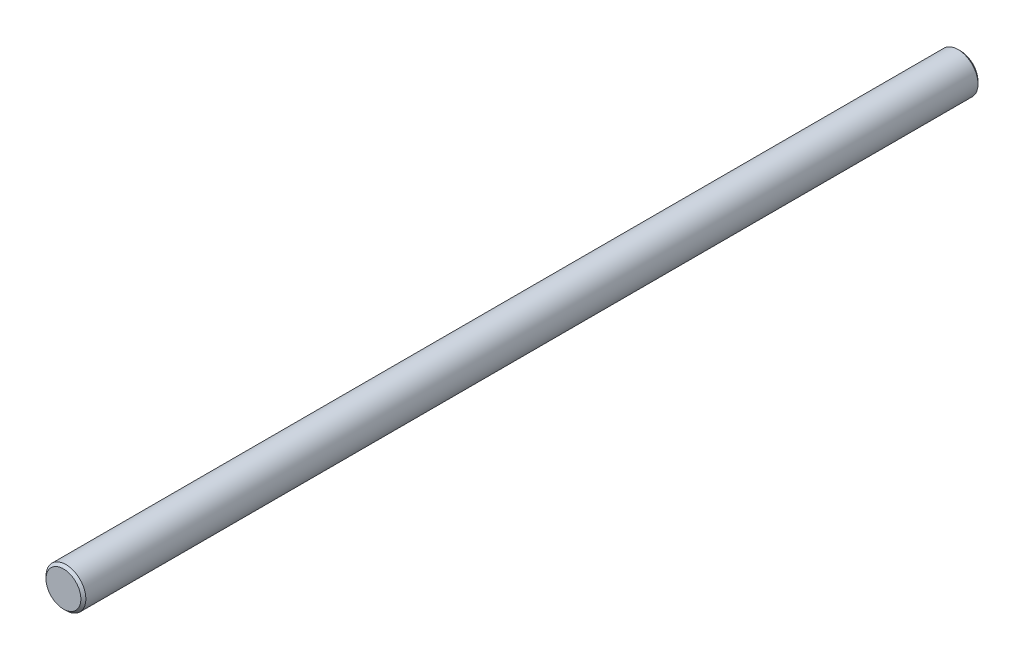
ISO-10303-21;
HEADER;
FILE_DESCRIPTION(('STEP AP214'),'2;1');
FILE_NAME('part.step','',(''),(''),'','','');
FILE_SCHEMA(('AUTOMOTIVE_DESIGN { 1 0 10303 214 1 1 1 1 }'));
ENDSEC;
DATA;
#1=APPLICATION_CONTEXT('core data for automotive mechanical design processes');
#2=APPLICATION_PROTOCOL_DEFINITION('international standard','automotive_design',2000,#1);
#3=PRODUCT_CONTEXT('',#1,'mechanical');
#4=PRODUCT('Part','Part','',(#3));
#5=PRODUCT_RELATED_PRODUCT_CATEGORY('part','',(#4));
#6=PRODUCT_DEFINITION_FORMATION('','',#4);
#7=PRODUCT_DEFINITION_CONTEXT('part definition',#1,'design');
#8=PRODUCT_DEFINITION('design','',#6,#7);
#9=PRODUCT_DEFINITION_SHAPE('','',#8);
#10=(LENGTH_UNIT() NAMED_UNIT(*) SI_UNIT(.MILLI.,.METRE.));
#11=(NAMED_UNIT(*) PLANE_ANGLE_UNIT() SI_UNIT($,.RADIAN.));
#12=(NAMED_UNIT(*) SI_UNIT($,.STERADIAN.) SOLID_ANGLE_UNIT());
#13=UNCERTAINTY_MEASURE_WITH_UNIT(LENGTH_MEASURE(1.E-05),#10,'distance_accuracy_value','');
#14=(GEOMETRIC_REPRESENTATION_CONTEXT(3) GLOBAL_UNCERTAINTY_ASSIGNED_CONTEXT((#13)) GLOBAL_UNIT_ASSIGNED_CONTEXT((#10,
#11,#12)) REPRESENTATION_CONTEXT('',''));
#15=CARTESIAN_POINT('',(0.,0.,0.));
#16=DIRECTION('',(0.,0.,1.));
#17=DIRECTION('',(1.,0.,0.));
#18=AXIS2_PLACEMENT_3D('',#15,#16,#17);
#19=CARTESIAN_POINT('',(-26.,0.,16.));
#20=DIRECTION('',(0.,0.,-1.));
#21=DIRECTION('',(-1.,0.,0.));
#22=AXIS2_PLACEMENT_3D('',#19,#20,#21);
#23=PLANE('',#22);
#24=CARTESIAN_POINT('',(-26.,0.,15.9999999999732));
#25=DIRECTION('',(0.,0.,1.));
#26=DIRECTION('',(1.,0.,0.));
#27=AXIS2_PLACEMENT_3D('',#24,#25,#26);
#28=CIRCLE('',#27,3.49999999997408);
#29=CARTESIAN_POINT('',(-22.5000000000259,0.,15.9999999999732));
#30=VERTEX_POINT('',#29);
#31=EDGE_CURVE('E18',#30,#30,#28,.T.);
#32=ORIENTED_EDGE('',*,*,#31,.F.);
#33=EDGE_LOOP('',(#32));
#34=FACE_BOUND('',#33,.T.);
#35=ADVANCED_FACE('F15',(#34),#23,.T.);
#36=CARTESIAN_POINT('',(-30.,0.,196.));
#37=DIRECTION('',(0.,0.,1.));
#38=DIRECTION('',(1.,0.,0.));
#39=AXIS2_PLACEMENT_3D('',#36,#37,#38);
#40=PLANE('',#39);
#41=CARTESIAN_POINT('',(-26.,0.,195.999999999959));
#42=DIRECTION('',(0.,0.,-1.));
#43=DIRECTION('',(-1.,0.,0.));
#44=AXIS2_PLACEMENT_3D('',#41,#42,#43);
#45=CIRCLE('',#44,3.50000000008777);
#46=CARTESIAN_POINT('',(-29.5000000000878,0.,195.999999999959));
#47=VERTEX_POINT('',#46);
#48=EDGE_CURVE('E27',#47,#47,#45,.T.);
#49=ORIENTED_EDGE('',*,*,#48,.F.);
#50=EDGE_LOOP('',(#49));
#51=FACE_BOUND('',#50,.T.);
#52=ADVANCED_FACE('F42',(#51),#40,.T.);
#53=CARTESIAN_POINT('',(-26.,0.,16.4999999999509));
#54=DIRECTION('',(0.,0.,1.));
#55=DIRECTION('',(1.,0.,0.));
#56=AXIS2_PLACEMENT_3D('',#53,#54,#55);
#57=CONICAL_SURFACE('',#56,3.9999999999518,0.785398163397448);
#58=CARTESIAN_POINT('',(-26.,0.,16.5));
#59=DIRECTION('',(0.,0.,-1.));
#60=DIRECTION('',(-1.,0.,0.));
#61=AXIS2_PLACEMENT_3D('',#58,#59,#60);
#62=CIRCLE('',#61,4.00000000000001);
#63=CARTESIAN_POINT('',(-30.,0.,16.5));
#64=VERTEX_POINT('',#63);
#65=EDGE_CURVE('E22',#64,#64,#62,.F.);
#66=ORIENTED_EDGE('',*,*,#65,.F.);
#67=EDGE_LOOP('',(#66));
#68=FACE_BOUND('',#67,.T.);
#69=ORIENTED_EDGE('',*,*,#31,.T.);
#70=EDGE_LOOP('',(#69));
#71=FACE_BOUND('',#70,.T.);
#72=ADVANCED_FACE('F39',(#68,#71),#57,.T.);
#73=CARTESIAN_POINT('',(-26.,0.,195.500000000095));
#74=DIRECTION('',(0.,0.,-1.));
#75=DIRECTION('',(-1.,0.,0.));
#76=AXIS2_PLACEMENT_3D('',#73,#74,#75);
#77=CONICAL_SURFACE('',#76,4.00000000000864,0.785398163454292);
#78=ORIENTED_EDGE('',*,*,#48,.T.);
#79=EDGE_LOOP('',(#78));
#80=FACE_BOUND('',#79,.T.);
#81=CARTESIAN_POINT('',(-26.,0.,195.5));
#82=DIRECTION('',(0.,0.,-1.));
#83=DIRECTION('',(-1.,0.,0.));
#84=AXIS2_PLACEMENT_3D('',#81,#82,#83);
#85=CIRCLE('',#84,4.00000000000001);
#86=CARTESIAN_POINT('',(-30.,0.,195.5));
#87=VERTEX_POINT('',#86);
#88=EDGE_CURVE('E10',#87,#87,#85,.T.);
#89=ORIENTED_EDGE('',*,*,#88,.F.);
#90=EDGE_LOOP('',(#89));
#91=FACE_BOUND('',#90,.T.);
#92=ADVANCED_FACE('F50',(#80,#91),#77,.T.);
#93=CARTESIAN_POINT('',(-26.,0.,106.));
#94=DIRECTION('',(0.,0.,-1.));
#95=DIRECTION('',(-1.,0.,0.));
#96=AXIS2_PLACEMENT_3D('',#93,#94,#95);
#97=CYLINDRICAL_SURFACE('',#96,4.00000000000001);
#98=ORIENTED_EDGE('',*,*,#88,.T.);
#99=EDGE_LOOP('',(#98));
#100=FACE_BOUND('',#99,.T.);
#101=ORIENTED_EDGE('',*,*,#65,.T.);
#102=EDGE_LOOP('',(#101));
#103=FACE_BOUND('',#102,.T.);
#104=ADVANCED_FACE('F48',(#100,#103),#97,.T.);
#105=CLOSED_SHELL('',(#35,#52,#72,#92,#104));
#106=MANIFOLD_SOLID_BREP('B1',#105);
#107=ADVANCED_BREP_SHAPE_REPRESENTATION('',(#18,#106),#14);
#108=SHAPE_DEFINITION_REPRESENTATION(#9,#107);
ENDSEC;
END-ISO-10303-21;
